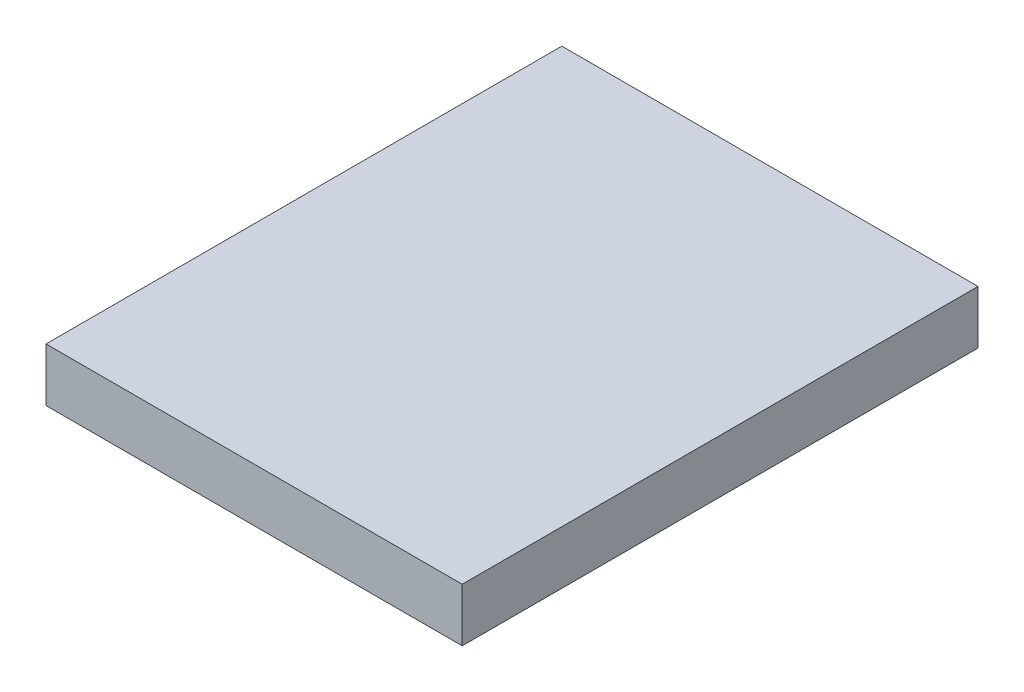
ISO-10303-21;
HEADER;
FILE_DESCRIPTION(('STEP AP214'),'2;1');
FILE_NAME('part.step','',(''),(''),'','','');
FILE_SCHEMA(('AUTOMOTIVE_DESIGN { 1 0 10303 214 1 1 1 1 }'));
ENDSEC;
DATA;
#1=APPLICATION_CONTEXT('core data for automotive mechanical design processes');
#2=APPLICATION_PROTOCOL_DEFINITION('international standard','automotive_design',2000,#1);
#3=PRODUCT_CONTEXT('',#1,'mechanical');
#4=PRODUCT('Part','Part','',(#3));
#5=PRODUCT_RELATED_PRODUCT_CATEGORY('part','',(#4));
#6=PRODUCT_DEFINITION_FORMATION('','',#4);
#7=PRODUCT_DEFINITION_CONTEXT('part definition',#1,'design');
#8=PRODUCT_DEFINITION('design','',#6,#7);
#9=PRODUCT_DEFINITION_SHAPE('','',#8);
#10=(LENGTH_UNIT() NAMED_UNIT(*) SI_UNIT(.MILLI.,.METRE.));
#11=(NAMED_UNIT(*) PLANE_ANGLE_UNIT() SI_UNIT($,.RADIAN.));
#12=(NAMED_UNIT(*) SI_UNIT($,.STERADIAN.) SOLID_ANGLE_UNIT());
#13=UNCERTAINTY_MEASURE_WITH_UNIT(LENGTH_MEASURE(1.E-05),#10,'distance_accuracy_value','');
#14=(GEOMETRIC_REPRESENTATION_CONTEXT(3) GLOBAL_UNCERTAINTY_ASSIGNED_CONTEXT((#13)) GLOBAL_UNIT_ASSIGNED_CONTEXT((#10,
#11,#12)) REPRESENTATION_CONTEXT('',''));
#15=CARTESIAN_POINT('',(0.,0.,0.));
#16=DIRECTION('',(0.,0.,1.));
#17=DIRECTION('',(1.,0.,0.));
#18=AXIS2_PLACEMENT_3D('',#15,#16,#17);
#19=CARTESIAN_POINT('',(11.7,3.,14.5));
#20=DIRECTION('',(-1.,0.,0.));
#21=DIRECTION('',(0.,0.,1.));
#22=AXIS2_PLACEMENT_3D('',#19,#20,#21);
#23=PLANE('',#22);
#24=DIRECTION('',(0.,0.,-1.));
#25=VECTOR('',#24,1.);
#26=CARTESIAN_POINT('',(11.7,0.,14.5));
#27=LINE('',#26,#25);
#28=CARTESIAN_POINT('',(11.7,0.,14.5));
#29=VERTEX_POINT('',#28);
#30=CARTESIAN_POINT('',(11.7,0.,-14.5));
#31=VERTEX_POINT('',#30);
#32=EDGE_CURVE('E97',#29,#31,#27,.T.);
#33=ORIENTED_EDGE('',*,*,#32,.T.);
#34=DIRECTION('',(0.,-1.,0.));
#35=VECTOR('',#34,1.);
#36=CARTESIAN_POINT('',(11.7,3.,-14.5));
#37=LINE('',#36,#35);
#38=CARTESIAN_POINT('',(11.7,3.,-14.5));
#39=VERTEX_POINT('',#38);
#40=EDGE_CURVE('E11',#39,#31,#37,.T.);
#41=ORIENTED_EDGE('',*,*,#40,.F.);
#42=DIRECTION('',(0.,0.,-1.));
#43=VECTOR('',#42,1.);
#44=CARTESIAN_POINT('',(11.7,3.,14.5));
#45=LINE('',#44,#43);
#46=CARTESIAN_POINT('',(11.7,3.,14.5));
#47=VERTEX_POINT('',#46);
#48=EDGE_CURVE('E85',#47,#39,#45,.T.);
#49=ORIENTED_EDGE('',*,*,#48,.F.);
#50=DIRECTION('',(0.,-1.,0.));
#51=VECTOR('',#50,1.);
#52=CARTESIAN_POINT('',(11.7,3.,14.5));
#53=LINE('',#52,#51);
#54=EDGE_CURVE('E93',#47,#29,#53,.T.);
#55=ORIENTED_EDGE('',*,*,#54,.T.);
#56=EDGE_LOOP('',(#33,#41,#49,#55));
#57=FACE_BOUND('',#56,.T.);
#58=ADVANCED_FACE('F34',(#57),#23,.F.);
#59=CARTESIAN_POINT('',(-11.7,3.,-14.5));
#60=DIRECTION('',(0.,0.,1.));
#61=DIRECTION('',(1.,0.,0.));
#62=AXIS2_PLACEMENT_3D('',#59,#60,#61);
#63=PLANE('',#62);
#64=DIRECTION('',(-1.,0.,0.));
#65=VECTOR('',#64,1.);
#66=CARTESIAN_POINT('',(-11.7,0.,-14.5));
#67=LINE('',#66,#65);
#68=CARTESIAN_POINT('',(-11.7,0.,-14.5));
#69=VERTEX_POINT('',#68);
#70=EDGE_CURVE('E89',#31,#69,#67,.T.);
#71=ORIENTED_EDGE('',*,*,#70,.T.);
#72=DIRECTION('',(0.,-1.,0.));
#73=VECTOR('',#72,1.);
#74=CARTESIAN_POINT('',(-11.7,3.,-14.5));
#75=LINE('',#74,#73);
#76=CARTESIAN_POINT('',(-11.7,3.,-14.5));
#77=VERTEX_POINT('',#76);
#78=EDGE_CURVE('E42',#77,#69,#75,.T.);
#79=ORIENTED_EDGE('',*,*,#78,.F.);
#80=DIRECTION('',(-1.,0.,0.));
#81=VECTOR('',#80,1.);
#82=CARTESIAN_POINT('',(-11.7,3.,-14.5));
#83=LINE('',#82,#81);
#84=EDGE_CURVE('E80',#39,#77,#83,.T.);
#85=ORIENTED_EDGE('',*,*,#84,.F.);
#86=ORIENTED_EDGE('',*,*,#40,.T.);
#87=EDGE_LOOP('',(#71,#79,#85,#86));
#88=FACE_BOUND('',#87,.T.);
#89=ADVANCED_FACE('F88',(#88),#63,.F.);
#90=CARTESIAN_POINT('',(-11.7,3.,14.5));
#91=DIRECTION('',(1.,0.,0.));
#92=DIRECTION('',(0.,0.,-1.));
#93=AXIS2_PLACEMENT_3D('',#90,#91,#92);
#94=PLANE('',#93);
#95=DIRECTION('',(0.,0.,1.));
#96=VECTOR('',#95,1.);
#97=CARTESIAN_POINT('',(-11.7,0.,14.5));
#98=LINE('',#97,#96);
#99=CARTESIAN_POINT('',(-11.7,0.,14.5));
#100=VERTEX_POINT('',#99);
#101=EDGE_CURVE('E67',#69,#100,#98,.T.);
#102=ORIENTED_EDGE('',*,*,#101,.T.);
#103=DIRECTION('',(0.,-1.,0.));
#104=VECTOR('',#103,1.);
#105=CARTESIAN_POINT('',(-11.7,3.,14.5));
#106=LINE('',#105,#104);
#107=CARTESIAN_POINT('',(-11.7,3.,14.5));
#108=VERTEX_POINT('',#107);
#109=EDGE_CURVE('E90',#108,#100,#106,.T.);
#110=ORIENTED_EDGE('',*,*,#109,.F.);
#111=DIRECTION('',(0.,0.,1.));
#112=VECTOR('',#111,1.);
#113=CARTESIAN_POINT('',(-11.7,3.,14.5));
#114=LINE('',#113,#112);
#115=EDGE_CURVE('E83',#77,#108,#114,.T.);
#116=ORIENTED_EDGE('',*,*,#115,.F.);
#117=ORIENTED_EDGE('',*,*,#78,.T.);
#118=EDGE_LOOP('',(#102,#110,#116,#117));
#119=FACE_BOUND('',#118,.T.);
#120=ADVANCED_FACE('F91',(#119),#94,.F.);
#121=CARTESIAN_POINT('',(-11.7,3.,14.5));
#122=DIRECTION('',(0.,0.,-1.));
#123=DIRECTION('',(-1.,0.,0.));
#124=AXIS2_PLACEMENT_3D('',#121,#122,#123);
#125=PLANE('',#124);
#126=DIRECTION('',(1.,0.,0.));
#127=VECTOR('',#126,1.);
#128=CARTESIAN_POINT('',(-11.7,0.,14.5));
#129=LINE('',#128,#127);
#130=EDGE_CURVE('E73',#100,#29,#129,.T.);
#131=ORIENTED_EDGE('',*,*,#130,.T.);
#132=ORIENTED_EDGE('',*,*,#54,.F.);
#133=DIRECTION('',(1.,0.,0.));
#134=VECTOR('',#133,1.);
#135=CARTESIAN_POINT('',(-11.7,3.,14.5));
#136=LINE('',#135,#134);
#137=EDGE_CURVE('E50',#108,#47,#136,.T.);
#138=ORIENTED_EDGE('',*,*,#137,.F.);
#139=ORIENTED_EDGE('',*,*,#109,.T.);
#140=EDGE_LOOP('',(#131,#132,#138,#139));
#141=FACE_BOUND('',#140,.T.);
#142=ADVANCED_FACE('F104',(#141),#125,.F.);
#143=CARTESIAN_POINT('',(0.,3.,0.));
#144=DIRECTION('',(0.,-1.,0.));
#145=DIRECTION('',(0.,0.,-1.));
#146=AXIS2_PLACEMENT_3D('',#143,#144,#145);
#147=PLANE('',#146);
#148=ORIENTED_EDGE('',*,*,#48,.T.);
#149=ORIENTED_EDGE('',*,*,#84,.T.);
#150=ORIENTED_EDGE('',*,*,#115,.T.);
#151=ORIENTED_EDGE('',*,*,#137,.T.);
#152=EDGE_LOOP('',(#148,#149,#150,#151));
#153=FACE_BOUND('',#152,.T.);
#154=ADVANCED_FACE('F81',(#153),#147,.F.);
#155=CARTESIAN_POINT('',(0.,0.,0.));
#156=DIRECTION('',(0.,-1.,0.));
#157=DIRECTION('',(0.,0.,-1.));
#158=AXIS2_PLACEMENT_3D('',#155,#156,#157);
#159=PLANE('',#158);
#160=ORIENTED_EDGE('',*,*,#32,.F.);
#161=ORIENTED_EDGE('',*,*,#130,.F.);
#162=ORIENTED_EDGE('',*,*,#101,.F.);
#163=ORIENTED_EDGE('',*,*,#70,.F.);
#164=EDGE_LOOP('',(#160,#161,#162,#163));
#165=FACE_BOUND('',#164,.T.);
#166=ADVANCED_FACE('F107',(#165),#159,.T.);
#167=CLOSED_SHELL('',(#58,#89,#120,#142,#154,#166));
#168=MANIFOLD_SOLID_BREP('B2',#167);
#169=ADVANCED_BREP_SHAPE_REPRESENTATION('',(#18,#168),#14);
#170=SHAPE_DEFINITION_REPRESENTATION(#9,#169);
ENDSEC;
END-ISO-10303-21;
